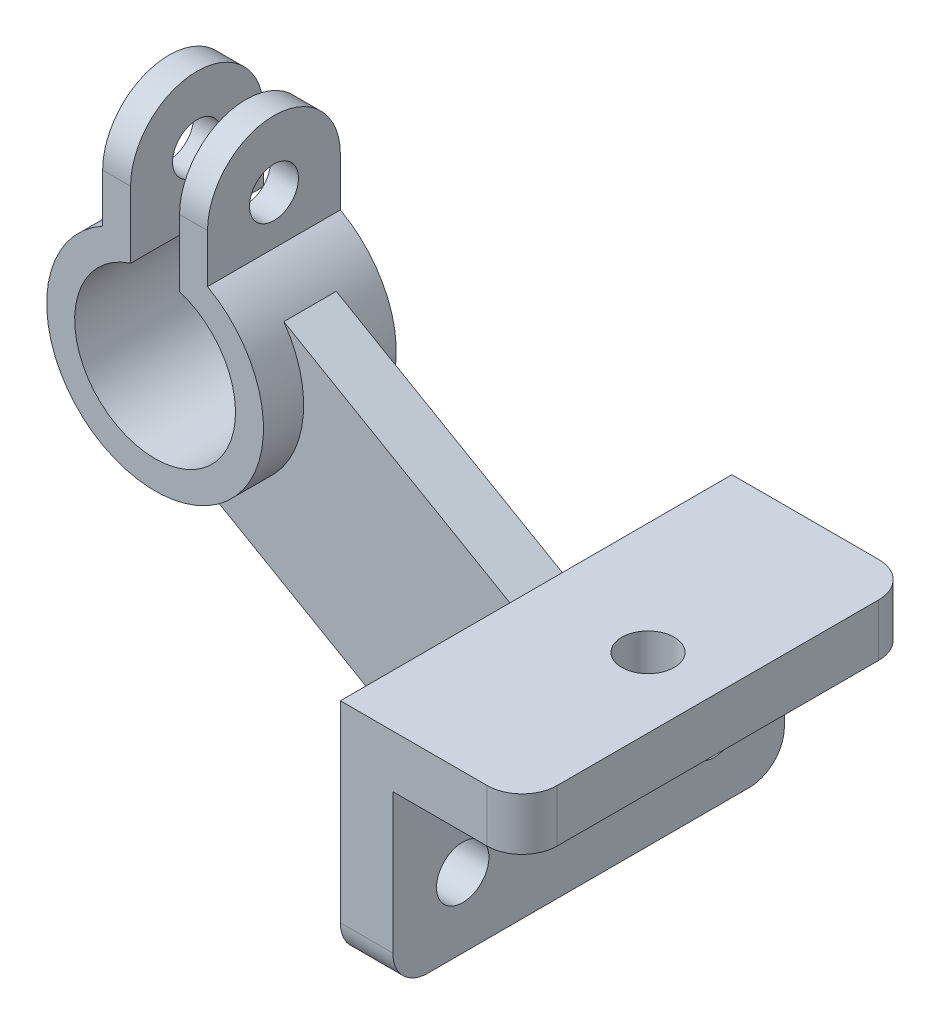
ISO-10303-21;
HEADER;
FILE_DESCRIPTION(('STEP AP214'),'2;1');
FILE_NAME('part.step','',(''),(''),'','','');
FILE_SCHEMA(('AUTOMOTIVE_DESIGN { 1 0 10303 214 1 1 1 1 }'));
ENDSEC;
DATA;
#1=APPLICATION_CONTEXT('core data for automotive mechanical design processes');
#2=APPLICATION_PROTOCOL_DEFINITION('international standard','automotive_design',2000,#1);
#3=PRODUCT_CONTEXT('',#1,'mechanical');
#4=PRODUCT('Part','Part','',(#3));
#5=PRODUCT_RELATED_PRODUCT_CATEGORY('part','',(#4));
#6=PRODUCT_DEFINITION_FORMATION('','',#4);
#7=PRODUCT_DEFINITION_CONTEXT('part definition',#1,'design');
#8=PRODUCT_DEFINITION('design','',#6,#7);
#9=PRODUCT_DEFINITION_SHAPE('','',#8);
#10=(LENGTH_UNIT() NAMED_UNIT(*) SI_UNIT(.MILLI.,.METRE.));
#11=(NAMED_UNIT(*) PLANE_ANGLE_UNIT() SI_UNIT($,.RADIAN.));
#12=(NAMED_UNIT(*) SI_UNIT($,.STERADIAN.) SOLID_ANGLE_UNIT());
#13=UNCERTAINTY_MEASURE_WITH_UNIT(LENGTH_MEASURE(1.E-05),#10,'distance_accuracy_value','');
#14=(GEOMETRIC_REPRESENTATION_CONTEXT(3) GLOBAL_UNCERTAINTY_ASSIGNED_CONTEXT((#13)) GLOBAL_UNIT_ASSIGNED_CONTEXT((#10,
#11,#12)) REPRESENTATION_CONTEXT('',''));
#15=CARTESIAN_POINT('',(0.,0.,0.));
#16=DIRECTION('',(0.,0.,1.));
#17=DIRECTION('',(1.,0.,0.));
#18=AXIS2_PLACEMENT_3D('',#15,#16,#17);
#19=CARTESIAN_POINT('',(-97.,125.461524227066,0.));
#20=DIRECTION('',(-1.,0.,0.));
#21=DIRECTION('',(0.,0.,1.));
#22=AXIS2_PLACEMENT_3D('',#19,#20,#21);
#23=CYLINDRICAL_SURFACE('',#22,19.);
#24=DIRECTION('',(1.,0.,0.));
#25=VECTOR('',#24,1.);
#26=CARTESIAN_POINT('',(-97.,125.461524227066,19.));
#27=LINE('',#26,#25);
#28=CARTESIAN_POINT('',(-97.,125.461524227066,19.));
#29=VERTEX_POINT('',#28);
#30=CARTESIAN_POINT('',(-105.,125.461524227066,19.));
#31=VERTEX_POINT('',#30);
#32=EDGE_CURVE('E322',#29,#31,#27,.F.);
#33=ORIENTED_EDGE('',*,*,#32,.F.);
#34=CARTESIAN_POINT('',(-97.,125.461524227066,0.));
#35=DIRECTION('',(-1.,0.,0.));
#36=DIRECTION('',(0.,0.,1.));
#37=AXIS2_PLACEMENT_3D('',#34,#35,#36);
#38=CIRCLE('',#37,19.);
#39=CARTESIAN_POINT('',(-97.,125.461524227066,-19.));
#40=VERTEX_POINT('',#39);
#41=EDGE_CURVE('E328',#40,#29,#38,.F.);
#42=ORIENTED_EDGE('',*,*,#41,.F.);
#43=DIRECTION('',(-1.,0.,0.));
#44=VECTOR('',#43,1.);
#45=CARTESIAN_POINT('',(-90.,125.461524227066,-19.));
#46=LINE('',#45,#44);
#47=CARTESIAN_POINT('',(-105.,125.461524227066,-19.));
#48=VERTEX_POINT('',#47);
#49=EDGE_CURVE('E325',#48,#40,#46,.F.);
#50=ORIENTED_EDGE('',*,*,#49,.F.);
#51=CARTESIAN_POINT('',(-105.,125.461524227066,0.));
#52=DIRECTION('',(1.,0.,0.));
#53=DIRECTION('',(0.,0.,-1.));
#54=AXIS2_PLACEMENT_3D('',#51,#52,#53);
#55=CIRCLE('',#54,19.);
#56=EDGE_CURVE('E330',#31,#48,#55,.F.);
#57=ORIENTED_EDGE('',*,*,#56,.F.);
#58=EDGE_LOOP('',(#33,#42,#50,#57));
#59=FACE_BOUND('',#58,.T.);
#60=ADVANCED_FACE('F38',(#59),#23,.T.);
#61=CARTESIAN_POINT('',(-75.,125.461524227066,0.));
#62=DIRECTION('',(-1.,0.,0.));
#63=DIRECTION('',(0.,0.,1.));
#64=AXIS2_PLACEMENT_3D('',#61,#62,#63);
#65=CYLINDRICAL_SURFACE('',#64,19.);
#66=DIRECTION('',(1.,0.,0.));
#67=VECTOR('',#66,1.);
#68=CARTESIAN_POINT('',(-75.,125.461524227066,19.));
#69=LINE('',#68,#67);
#70=CARTESIAN_POINT('',(-75.,125.461524227066,19.));
#71=VERTEX_POINT('',#70);
#72=CARTESIAN_POINT('',(-83.,125.461524227066,19.));
#73=VERTEX_POINT('',#72);
#74=EDGE_CURVE('E213',#71,#73,#69,.F.);
#75=ORIENTED_EDGE('',*,*,#74,.F.);
#76=CARTESIAN_POINT('',(-75.,125.461524227066,0.));
#77=DIRECTION('',(-1.,0.,0.));
#78=DIRECTION('',(0.,0.,1.));
#79=AXIS2_PLACEMENT_3D('',#76,#77,#78);
#80=CIRCLE('',#79,19.);
#81=CARTESIAN_POINT('',(-75.,125.461524227066,-19.));
#82=VERTEX_POINT('',#81);
#83=EDGE_CURVE('E318',#82,#71,#80,.F.);
#84=ORIENTED_EDGE('',*,*,#83,.F.);
#85=DIRECTION('',(-1.,0.,0.));
#86=VECTOR('',#85,1.);
#87=CARTESIAN_POINT('',(-90.,125.461524227066,-19.));
#88=LINE('',#87,#86);
#89=CARTESIAN_POINT('',(-83.,125.461524227066,-19.));
#90=VERTEX_POINT('',#89);
#91=EDGE_CURVE('E315',#90,#82,#88,.F.);
#92=ORIENTED_EDGE('',*,*,#91,.F.);
#93=CARTESIAN_POINT('',(-83.,125.461524227066,0.));
#94=DIRECTION('',(1.,0.,0.));
#95=DIRECTION('',(0.,0.,-1.));
#96=AXIS2_PLACEMENT_3D('',#93,#94,#95);
#97=CIRCLE('',#96,19.);
#98=EDGE_CURVE('E320',#73,#90,#97,.F.);
#99=ORIENTED_EDGE('',*,*,#98,.F.);
#100=EDGE_LOOP('',(#75,#84,#92,#99));
#101=FACE_BOUND('',#100,.T.);
#102=ADVANCED_FACE('F437',(#101),#65,.T.);
#103=CARTESIAN_POINT('',(0.,65.,7.5));
#104=DIRECTION('',(-0.500000000000001,-0.866025403784438,0.));
#105=DIRECTION('',(0.866025403784438,-0.500000000000001,0.));
#106=AXIS2_PLACEMENT_3D('',#103,#104,#105);
#107=PLANE('',#106);
#108=DIRECTION('',(0.,0.,-1.));
#109=VECTOR('',#108,1.);
#110=CARTESIAN_POINT('',(-64.6750040480351,102.340130996973,19.));
#111=LINE('',#110,#109);
#112=CARTESIAN_POINT('',(-64.675004048035,102.340130996973,7.5));
#113=VERTEX_POINT('',#112);
#114=CARTESIAN_POINT('',(-64.675004048035,102.340130996973,-7.5));
#115=VERTEX_POINT('',#114);
#116=EDGE_CURVE('E243',#113,#115,#111,.T.);
#117=ORIENTED_EDGE('',*,*,#116,.F.);
#118=DIRECTION('',(-0.866025403784438,0.500000000000001,0.));
#119=VECTOR('',#118,1.);
#120=CARTESIAN_POINT('',(0.,65.,7.5));
#121=LINE('',#120,#119);
#122=CARTESIAN_POINT('',(0.,65.,7.5));
#123=VERTEX_POINT('',#122);
#124=EDGE_CURVE('E252',#123,#113,#121,.T.);
#125=ORIENTED_EDGE('',*,*,#124,.F.);
#126=DIRECTION('',(0.,0.,-1.));
#127=VECTOR('',#126,1.);
#128=CARTESIAN_POINT('',(0.,65.,7.5));
#129=LINE('',#128,#127);
#130=CARTESIAN_POINT('',(0.,65.,-7.5));
#131=VERTEX_POINT('',#130);
#132=EDGE_CURVE('E267',#123,#131,#129,.T.);
#133=ORIENTED_EDGE('',*,*,#132,.T.);
#134=DIRECTION('',(-0.866025403784438,0.500000000000001,0.));
#135=VECTOR('',#134,1.);
#136=CARTESIAN_POINT('',(0.,65.,-7.5));
#137=LINE('',#136,#135);
#138=EDGE_CURVE('E261',#131,#115,#137,.T.);
#139=ORIENTED_EDGE('',*,*,#138,.T.);
#140=EDGE_LOOP('',(#117,#125,#133,#139));
#141=FACE_BOUND('',#140,.T.);
#142=ADVANCED_FACE('F434',(#141),#107,.F.);
#143=CARTESIAN_POINT('',(-104.072912811497,60.0865242270664,7.5));
#144=DIRECTION('',(0.500000000000001,0.866025403784438,0.));
#145=DIRECTION('',(-0.866025403784438,0.500000000000001,0.));
#146=AXIS2_PLACEMENT_3D('',#143,#144,#145);
#147=PLANE('',#146);
#148=DIRECTION('',(0.,0.,-1.));
#149=VECTOR('',#148,1.);
#150=CARTESIAN_POINT('',(-92.8208296710294,53.5901309969733,19.));
#151=LINE('',#150,#149);
#152=CARTESIAN_POINT('',(-92.8208296710294,53.5901309969733,-7.5));
#153=VERTEX_POINT('',#152);
#154=CARTESIAN_POINT('',(-92.8208296710294,53.5901309969733,7.5));
#155=VERTEX_POINT('',#154);
#156=EDGE_CURVE('E240',#153,#155,#151,.F.);
#157=ORIENTED_EDGE('',*,*,#156,.F.);
#158=DIRECTION('',(0.866025403784438,-0.500000000000001,0.));
#159=VECTOR('',#158,1.);
#160=CARTESIAN_POINT('',(-104.072912811497,60.0865242270664,-7.5));
#161=LINE('',#160,#159);
#162=CARTESIAN_POINT('',(0.,0.,-7.5));
#163=VERTEX_POINT('',#162);
#164=EDGE_CURVE('E253',#153,#163,#161,.T.);
#165=ORIENTED_EDGE('',*,*,#164,.T.);
#166=DIRECTION('',(0.,0.,-1.));
#167=VECTOR('',#166,1.);
#168=CARTESIAN_POINT('',(0.,0.,7.5));
#169=LINE('',#168,#167);
#170=CARTESIAN_POINT('',(0.,0.,7.5));
#171=VERTEX_POINT('',#170);
#172=EDGE_CURVE('E259',#171,#163,#169,.T.);
#173=ORIENTED_EDGE('',*,*,#172,.F.);
#174=DIRECTION('',(0.866025403784438,-0.500000000000001,0.));
#175=VECTOR('',#174,1.);
#176=CARTESIAN_POINT('',(-104.072912811497,60.0865242270664,7.5));
#177=LINE('',#176,#175);
#178=EDGE_CURVE('E256',#155,#171,#177,.T.);
#179=ORIENTED_EDGE('',*,*,#178,.F.);
#180=EDGE_LOOP('',(#157,#165,#173,#179));
#181=FACE_BOUND('',#180,.T.);
#182=ADVANCED_FACE('F426',(#181),#147,.F.);
#183=CARTESIAN_POINT('',(0.,0.,56.));
#184=DIRECTION('',(1.,0.,0.));
#185=DIRECTION('',(0.,0.,-1.));
#186=AXIS2_PLACEMENT_3D('',#183,#184,#185);
#187=PLANE('',#186);
#188=CARTESIAN_POINT('',(0.,20.,36.));
#189=DIRECTION('',(1.,0.,0.));
#190=DIRECTION('',(0.,0.,-1.));
#191=AXIS2_PLACEMENT_3D('',#188,#189,#190);
#192=CIRCLE('',#191,7.5);
#193=CARTESIAN_POINT('',(0.,20.,28.5));
#194=VERTEX_POINT('',#193);
#195=EDGE_CURVE('E748',#194,#194,#192,.F.);
#196=ORIENTED_EDGE('',*,*,#195,.F.);
#197=EDGE_LOOP('',(#196));
#198=FACE_BOUND('',#197,.T.);
#199=DIRECTION('',(0.,0.,-1.));
#200=VECTOR('',#199,1.);
#201=CARTESIAN_POINT('',(0.,0.,56.));
#202=LINE('',#201,#200);
#203=CARTESIAN_POINT('',(0.,0.,46.));
#204=VERTEX_POINT('',#203);
#205=EDGE_CURVE('E290',#204,#171,#202,.T.);
#206=ORIENTED_EDGE('',*,*,#205,.F.);
#207=CARTESIAN_POINT('',(0.,10.,46.));
#208=DIRECTION('',(1.,0.,0.));
#209=DIRECTION('',(0.,0.,-1.));
#210=AXIS2_PLACEMENT_3D('',#207,#208,#209);
#211=CIRCLE('',#210,10.);
#212=CARTESIAN_POINT('',(0.,10.,56.));
#213=VERTEX_POINT('',#212);
#214=EDGE_CURVE('E358',#204,#213,#211,.F.);
#215=ORIENTED_EDGE('',*,*,#214,.T.);
#216=DIRECTION('',(0.,-1.,0.));
#217=VECTOR('',#216,1.);
#218=CARTESIAN_POINT('',(0.,0.,56.));
#219=LINE('',#218,#217);
#220=CARTESIAN_POINT('',(0.,65.,56.));
#221=VERTEX_POINT('',#220);
#222=EDGE_CURVE('E279',#221,#213,#219,.T.);
#223=ORIENTED_EDGE('',*,*,#222,.F.);
#224=DIRECTION('',(0.,0.,-1.));
#225=VECTOR('',#224,1.);
#226=CARTESIAN_POINT('',(0.,65.,56.));
#227=LINE('',#226,#225);
#228=EDGE_CURVE('E293',#221,#123,#227,.T.);
#229=ORIENTED_EDGE('',*,*,#228,.T.);
#230=DIRECTION('',(0.,1.,0.));
#231=VECTOR('',#230,1.);
#232=CARTESIAN_POINT('',(0.,65.,7.5));
#233=LINE('',#232,#231);
#234=EDGE_CURVE('E249',#171,#123,#233,.T.);
#235=ORIENTED_EDGE('',*,*,#234,.F.);
#236=EDGE_LOOP('',(#206,#215,#223,#229,#235));
#237=FACE_BOUND('',#236,.T.);
#238=ADVANCED_FACE('F415',(#198,#237),#187,.F.);
#239=CARTESIAN_POINT('',(15.,0.,56.));
#240=DIRECTION('',(0.,1.,0.));
#241=DIRECTION('',(0.,0.,1.));
#242=AXIS2_PLACEMENT_3D('',#239,#240,#241);
#243=PLANE('',#242);
#244=CARTESIAN_POINT('',(0.,0.,-46.));
#245=VERTEX_POINT('',#244);
#246=EDGE_CURVE('E282',#163,#245,#202,.T.);
#247=ORIENTED_EDGE('',*,*,#246,.T.);
#248=DIRECTION('',(1.,0.,0.));
#249=VECTOR('',#248,1.);
#250=CARTESIAN_POINT('',(15.,0.,-46.));
#251=LINE('',#250,#249);
#252=CARTESIAN_POINT('',(15.,0.,-46.));
#253=VERTEX_POINT('',#252);
#254=EDGE_CURVE('E339',#245,#253,#251,.T.);
#255=ORIENTED_EDGE('',*,*,#254,.T.);
#256=DIRECTION('',(0.,0.,-1.));
#257=VECTOR('',#256,1.);
#258=CARTESIAN_POINT('',(15.,0.,56.));
#259=LINE('',#258,#257);
#260=CARTESIAN_POINT('',(15.,0.,46.));
#261=VERTEX_POINT('',#260);
#262=EDGE_CURVE('E303',#261,#253,#259,.T.);
#263=ORIENTED_EDGE('',*,*,#262,.F.);
#264=DIRECTION('',(1.,0.,0.));
#265=VECTOR('',#264,1.);
#266=CARTESIAN_POINT('',(15.,0.,46.));
#267=LINE('',#266,#265);
#268=EDGE_CURVE('E332',#261,#204,#267,.F.);
#269=ORIENTED_EDGE('',*,*,#268,.T.);
#270=ORIENTED_EDGE('',*,*,#205,.T.);
#271=ORIENTED_EDGE('',*,*,#172,.T.);
#272=EDGE_LOOP('',(#247,#255,#263,#269,#270,#271));
#273=FACE_BOUND('',#272,.T.);
#274=ADVANCED_FACE('F404',(#273),#243,.F.);
#275=CARTESIAN_POINT('',(15.,50.,56.));
#276=DIRECTION('',(-1.,0.,0.));
#277=DIRECTION('',(0.,-1.,0.));
#278=AXIS2_PLACEMENT_3D('',#275,#276,#277);
#279=PLANE('',#278);
#280=CARTESIAN_POINT('',(15.,20.,36.));
#281=DIRECTION('',(1.,0.,0.));
#282=DIRECTION('',(0.,1.,0.));
#283=AXIS2_PLACEMENT_3D('',#280,#281,#282);
#284=CIRCLE('',#283,7.5);
#285=CARTESIAN_POINT('',(15.,27.5,36.));
#286=VERTEX_POINT('',#285);
#287=EDGE_CURVE('E752',#286,#286,#284,.T.);
#288=ORIENTED_EDGE('',*,*,#287,.F.);
#289=EDGE_LOOP('',(#288));
#290=FACE_BOUND('',#289,.T.);
#291=CARTESIAN_POINT('',(15.,20.,-36.));
#292=DIRECTION('',(1.,0.,0.));
#293=DIRECTION('',(0.,1.,0.));
#294=AXIS2_PLACEMENT_3D('',#291,#292,#293);
#295=CIRCLE('',#294,7.5);
#296=CARTESIAN_POINT('',(15.,27.5,-36.));
#297=VERTEX_POINT('',#296);
#298=EDGE_CURVE('E753',#297,#297,#295,.T.);
#299=ORIENTED_EDGE('',*,*,#298,.F.);
#300=EDGE_LOOP('',(#299));
#301=FACE_BOUND('',#300,.T.);
#302=ORIENTED_EDGE('',*,*,#262,.T.);
#303=CARTESIAN_POINT('',(15.,10.,-46.));
#304=DIRECTION('',(-1.,0.,0.));
#305=DIRECTION('',(0.,-1.,0.));
#306=AXIS2_PLACEMENT_3D('',#303,#304,#305);
#307=CIRCLE('',#306,10.);
#308=CARTESIAN_POINT('',(15.,10.,-56.));
#309=VERTEX_POINT('',#308);
#310=EDGE_CURVE('E344',#253,#309,#307,.F.);
#311=ORIENTED_EDGE('',*,*,#310,.T.);
#312=DIRECTION('',(0.,1.,0.));
#313=VECTOR('',#312,1.);
#314=CARTESIAN_POINT('',(15.,50.,-56.));
#315=LINE('',#314,#313);
#316=CARTESIAN_POINT('',(15.,50.,-56.));
#317=VERTEX_POINT('',#316);
#318=EDGE_CURVE('E270',#309,#317,#315,.T.);
#319=ORIENTED_EDGE('',*,*,#318,.T.);
#320=DIRECTION('',(0.,0.,-1.));
#321=VECTOR('',#320,1.);
#322=CARTESIAN_POINT('',(15.,50.,56.));
#323=LINE('',#322,#321);
#324=CARTESIAN_POINT('',(15.,50.,56.));
#325=VERTEX_POINT('',#324);
#326=EDGE_CURVE('E300',#325,#317,#323,.T.);
#327=ORIENTED_EDGE('',*,*,#326,.F.);
#328=DIRECTION('',(0.,1.,0.));
#329=VECTOR('',#328,1.);
#330=CARTESIAN_POINT('',(15.,50.,56.));
#331=LINE('',#330,#329);
#332=CARTESIAN_POINT('',(15.,10.,56.));
#333=VERTEX_POINT('',#332);
#334=EDGE_CURVE('E271',#333,#325,#331,.T.);
#335=ORIENTED_EDGE('',*,*,#334,.F.);
#336=CARTESIAN_POINT('',(15.,10.,46.));
#337=DIRECTION('',(-1.,0.,0.));
#338=DIRECTION('',(0.,-1.,0.));
#339=AXIS2_PLACEMENT_3D('',#336,#337,#338);
#340=CIRCLE('',#339,10.);
#341=EDGE_CURVE('E342',#333,#261,#340,.F.);
#342=ORIENTED_EDGE('',*,*,#341,.T.);
#343=EDGE_LOOP('',(#302,#311,#319,#327,#335,#342));
#344=FACE_BOUND('',#343,.T.);
#345=ADVANCED_FACE('F407',(#290,#301,#344),#279,.F.);
#346=CARTESIAN_POINT('',(52.,50.,56.));
#347=DIRECTION('',(0.,1.,0.));
#348=DIRECTION('',(0.,0.,1.));
#349=AXIS2_PLACEMENT_3D('',#346,#347,#348);
#350=PLANE('',#349);
#351=CARTESIAN_POINT('',(32.,50.,0.));
#352=DIRECTION('',(0.,1.,0.));
#353=DIRECTION('',(0.,0.,1.));
#354=AXIS2_PLACEMENT_3D('',#351,#352,#353);
#355=CIRCLE('',#354,7.5);
#356=CARTESIAN_POINT('',(32.,50.,7.5));
#357=VERTEX_POINT('',#356);
#358=EDGE_CURVE('E734',#357,#357,#355,.F.);
#359=ORIENTED_EDGE('',*,*,#358,.F.);
#360=EDGE_LOOP('',(#359));
#361=FACE_BOUND('',#360,.T.);
#362=DIRECTION('',(1.,0.,0.));
#363=VECTOR('',#362,1.);
#364=CARTESIAN_POINT('',(52.,50.,-56.));
#365=LINE('',#364,#363);
#366=CARTESIAN_POINT('',(42.,50.,-56.));
#367=VERTEX_POINT('',#366);
#368=EDGE_CURVE('E284',#317,#367,#365,.T.);
#369=ORIENTED_EDGE('',*,*,#368,.T.);
#370=CARTESIAN_POINT('',(42.,50.,-46.));
#371=DIRECTION('',(0.,1.,0.));
#372=DIRECTION('',(0.,0.,1.));
#373=AXIS2_PLACEMENT_3D('',#370,#371,#372);
#374=CIRCLE('',#373,10.);
#375=CARTESIAN_POINT('',(52.,50.,-46.));
#376=VERTEX_POINT('',#375);
#377=EDGE_CURVE('E11',#367,#376,#374,.F.);
#378=ORIENTED_EDGE('',*,*,#377,.T.);
#379=DIRECTION('',(0.,0.,-1.));
#380=VECTOR('',#379,1.);
#381=CARTESIAN_POINT('',(52.,50.,56.));
#382=LINE('',#381,#380);
#383=CARTESIAN_POINT('',(52.,50.,46.));
#384=VERTEX_POINT('',#383);
#385=EDGE_CURVE('E298',#384,#376,#382,.T.);
#386=ORIENTED_EDGE('',*,*,#385,.F.);
#387=CARTESIAN_POINT('',(42.,50.,46.));
#388=DIRECTION('',(0.,1.,0.));
#389=DIRECTION('',(0.,0.,1.));
#390=AXIS2_PLACEMENT_3D('',#387,#388,#389);
#391=CIRCLE('',#390,10.);
#392=CARTESIAN_POINT('',(42.,50.,56.));
#393=VERTEX_POINT('',#392);
#394=EDGE_CURVE('E46',#384,#393,#391,.F.);
#395=ORIENTED_EDGE('',*,*,#394,.T.);
#396=DIRECTION('',(1.,0.,0.));
#397=VECTOR('',#396,1.);
#398=CARTESIAN_POINT('',(52.,50.,56.));
#399=LINE('',#398,#397);
#400=EDGE_CURVE('E273',#325,#393,#399,.T.);
#401=ORIENTED_EDGE('',*,*,#400,.F.);
#402=ORIENTED_EDGE('',*,*,#326,.T.);
#403=EDGE_LOOP('',(#369,#378,#386,#395,#401,#402));
#404=FACE_BOUND('',#403,.T.);
#405=ADVANCED_FACE('F369',(#361,#404),#350,.F.);
#406=CARTESIAN_POINT('',(52.,65.,56.));
#407=DIRECTION('',(-1.,0.,0.));
#408=DIRECTION('',(0.,-1.,0.));
#409=AXIS2_PLACEMENT_3D('',#406,#407,#408);
#410=PLANE('',#409);
#411=ORIENTED_EDGE('',*,*,#385,.T.);
#412=DIRECTION('',(0.,1.,0.));
#413=VECTOR('',#412,1.);
#414=CARTESIAN_POINT('',(52.,65.,-46.));
#415=LINE('',#414,#413);
#416=CARTESIAN_POINT('',(52.,65.,-46.));
#417=VERTEX_POINT('',#416);
#418=EDGE_CURVE('E361',#376,#417,#415,.T.);
#419=ORIENTED_EDGE('',*,*,#418,.T.);
#420=DIRECTION('',(0.,0.,-1.));
#421=VECTOR('',#420,1.);
#422=CARTESIAN_POINT('',(52.,65.,56.));
#423=LINE('',#422,#421);
#424=CARTESIAN_POINT('',(52.,65.,46.));
#425=VERTEX_POINT('',#424);
#426=EDGE_CURVE('E295',#425,#417,#423,.T.);
#427=ORIENTED_EDGE('',*,*,#426,.F.);
#428=DIRECTION('',(0.,1.,0.));
#429=VECTOR('',#428,1.);
#430=CARTESIAN_POINT('',(52.,65.,46.));
#431=LINE('',#430,#429);
#432=EDGE_CURVE('E58',#425,#384,#431,.F.);
#433=ORIENTED_EDGE('',*,*,#432,.T.);
#434=EDGE_LOOP('',(#411,#419,#427,#433));
#435=FACE_BOUND('',#434,.T.);
#436=ADVANCED_FACE('F380',(#435),#410,.F.);
#437=CARTESIAN_POINT('',(0.,65.,56.));
#438=DIRECTION('',(0.,-1.,0.));
#439=DIRECTION('',(0.,0.,-1.));
#440=AXIS2_PLACEMENT_3D('',#437,#438,#439);
#441=PLANE('',#440);
#442=CARTESIAN_POINT('',(32.,65.,0.));
#443=DIRECTION('',(0.,1.,0.));
#444=DIRECTION('',(0.,0.,1.));
#445=AXIS2_PLACEMENT_3D('',#442,#443,#444);
#446=CIRCLE('',#445,7.5);
#447=CARTESIAN_POINT('',(32.,65.,7.5));
#448=VERTEX_POINT('',#447);
#449=EDGE_CURVE('E737',#448,#448,#446,.T.);
#450=ORIENTED_EDGE('',*,*,#449,.F.);
#451=EDGE_LOOP('',(#450));
#452=FACE_BOUND('',#451,.T.);
#453=ORIENTED_EDGE('',*,*,#426,.T.);
#454=CARTESIAN_POINT('',(42.,65.,-46.));
#455=DIRECTION('',(0.,-1.,0.));
#456=DIRECTION('',(0.,0.,-1.));
#457=AXIS2_PLACEMENT_3D('',#454,#455,#456);
#458=CIRCLE('',#457,10.);
#459=CARTESIAN_POINT('',(42.,65.,-56.));
#460=VERTEX_POINT('',#459);
#461=EDGE_CURVE('E366',#417,#460,#458,.F.);
#462=ORIENTED_EDGE('',*,*,#461,.T.);
#463=DIRECTION('',(-1.,0.,0.));
#464=VECTOR('',#463,1.);
#465=CARTESIAN_POINT('',(0.,65.,-56.));
#466=LINE('',#465,#464);
#467=CARTESIAN_POINT('',(0.,65.,-56.));
#468=VERTEX_POINT('',#467);
#469=EDGE_CURVE('E286',#460,#468,#466,.T.);
#470=ORIENTED_EDGE('',*,*,#469,.T.);
#471=EDGE_CURVE('E292',#131,#468,#227,.T.);
#472=ORIENTED_EDGE('',*,*,#471,.F.);
#473=ORIENTED_EDGE('',*,*,#132,.F.);
#474=ORIENTED_EDGE('',*,*,#228,.F.);
#475=DIRECTION('',(-1.,0.,0.));
#476=VECTOR('',#475,1.);
#477=CARTESIAN_POINT('',(0.,65.,56.));
#478=LINE('',#477,#476);
#479=CARTESIAN_POINT('',(42.,65.,56.));
#480=VERTEX_POINT('',#479);
#481=EDGE_CURVE('E277',#480,#221,#478,.T.);
#482=ORIENTED_EDGE('',*,*,#481,.F.);
#483=CARTESIAN_POINT('',(42.,65.,46.));
#484=DIRECTION('',(0.,-1.,0.));
#485=DIRECTION('',(0.,0.,-1.));
#486=AXIS2_PLACEMENT_3D('',#483,#484,#485);
#487=CIRCLE('',#486,10.);
#488=EDGE_CURVE('E364',#480,#425,#487,.F.);
#489=ORIENTED_EDGE('',*,*,#488,.T.);
#490=EDGE_LOOP('',(#453,#462,#470,#472,#473,#474,#482,#489));
#491=FACE_BOUND('',#490,.T.);
#492=ADVANCED_FACE('F378',(#452,#491),#441,.F.);
#493=CARTESIAN_POINT('',(0.,20.,-36.));
#494=DIRECTION('',(1.,0.,0.));
#495=DIRECTION('',(0.,0.,-1.));
#496=AXIS2_PLACEMENT_3D('',#493,#494,#495);
#497=CIRCLE('',#496,7.5);
#498=CARTESIAN_POINT('',(0.,20.,-43.5));
#499=VERTEX_POINT('',#498);
#500=EDGE_CURVE('E749',#499,#499,#497,.F.);
#501=ORIENTED_EDGE('',*,*,#500,.F.);
#502=EDGE_LOOP('',(#501));
#503=FACE_BOUND('',#502,.T.);
#504=DIRECTION('',(0.,-1.,0.));
#505=VECTOR('',#504,1.);
#506=CARTESIAN_POINT('',(0.,0.,-56.));
#507=LINE('',#506,#505);
#508=CARTESIAN_POINT('',(0.,10.,-56.));
#509=VERTEX_POINT('',#508);
#510=EDGE_CURVE('E274',#468,#509,#507,.T.);
#511=ORIENTED_EDGE('',*,*,#510,.T.);
#512=CARTESIAN_POINT('',(0.,10.,-46.));
#513=DIRECTION('',(1.,0.,0.));
#514=DIRECTION('',(0.,0.,-1.));
#515=AXIS2_PLACEMENT_3D('',#512,#513,#514);
#516=CIRCLE('',#515,10.);
#517=EDGE_CURVE('E350',#509,#245,#516,.F.);
#518=ORIENTED_EDGE('',*,*,#517,.T.);
#519=ORIENTED_EDGE('',*,*,#246,.F.);
#520=DIRECTION('',(0.,1.,0.));
#521=VECTOR('',#520,1.);
#522=CARTESIAN_POINT('',(0.,65.,-7.5));
#523=LINE('',#522,#521);
#524=EDGE_CURVE('E248',#163,#131,#523,.T.);
#525=ORIENTED_EDGE('',*,*,#524,.T.);
#526=ORIENTED_EDGE('',*,*,#471,.T.);
#527=EDGE_LOOP('',(#511,#518,#519,#525,#526));
#528=FACE_BOUND('',#527,.T.);
#529=ADVANCED_FACE('F396',(#503,#528),#187,.F.);
#530=CARTESIAN_POINT('',(0.,0.,56.));
#531=DIRECTION('',(0.,0.,-1.));
#532=DIRECTION('',(-1.,0.,0.));
#533=AXIS2_PLACEMENT_3D('',#530,#531,#532);
#534=PLANE('',#533);
#535=ORIENTED_EDGE('',*,*,#222,.T.);
#536=DIRECTION('',(1.,0.,0.));
#537=VECTOR('',#536,1.);
#538=CARTESIAN_POINT('',(0.,10.,56.));
#539=LINE('',#538,#537);
#540=EDGE_CURVE('E355',#213,#333,#539,.T.);
#541=ORIENTED_EDGE('',*,*,#540,.T.);
#542=ORIENTED_EDGE('',*,*,#334,.T.);
#543=ORIENTED_EDGE('',*,*,#400,.T.);
#544=DIRECTION('',(0.,1.,0.));
#545=VECTOR('',#544,1.);
#546=CARTESIAN_POINT('',(42.,0.,56.));
#547=LINE('',#546,#545);
#548=EDGE_CURVE('E352',#393,#480,#547,.T.);
#549=ORIENTED_EDGE('',*,*,#548,.T.);
#550=ORIENTED_EDGE('',*,*,#481,.T.);
#551=EDGE_LOOP('',(#535,#541,#542,#543,#549,#550));
#552=FACE_BOUND('',#551,.T.);
#553=ADVANCED_FACE('F373',(#552),#534,.F.);
#554=CARTESIAN_POINT('',(0.,0.,-56.));
#555=DIRECTION('',(0.,0.,-1.));
#556=DIRECTION('',(-1.,0.,0.));
#557=AXIS2_PLACEMENT_3D('',#554,#555,#556);
#558=PLANE('',#557);
#559=ORIENTED_EDGE('',*,*,#318,.F.);
#560=DIRECTION('',(1.,0.,0.));
#561=VECTOR('',#560,1.);
#562=CARTESIAN_POINT('',(0.,10.,-56.));
#563=LINE('',#562,#561);
#564=EDGE_CURVE('E348',#309,#509,#563,.F.);
#565=ORIENTED_EDGE('',*,*,#564,.T.);
#566=ORIENTED_EDGE('',*,*,#510,.F.);
#567=ORIENTED_EDGE('',*,*,#469,.F.);
#568=DIRECTION('',(0.,1.,0.));
#569=VECTOR('',#568,1.);
#570=CARTESIAN_POINT('',(42.,50.,-56.));
#571=LINE('',#570,#569);
#572=EDGE_CURVE('E346',#460,#367,#571,.F.);
#573=ORIENTED_EDGE('',*,*,#572,.T.);
#574=ORIENTED_EDGE('',*,*,#368,.F.);
#575=EDGE_LOOP('',(#559,#565,#566,#567,#573,#574));
#576=FACE_BOUND('',#575,.T.);
#577=ADVANCED_FACE('F391',(#576),#558,.T.);
#578=CARTESIAN_POINT('',(0.,0.,7.5));
#579=DIRECTION('',(0.,0.,1.));
#580=DIRECTION('',(1.,0.,0.));
#581=AXIS2_PLACEMENT_3D('',#578,#579,#580);
#582=PLANE('',#581);
#583=ORIENTED_EDGE('',*,*,#124,.T.);
#584=CARTESIAN_POINT('',(-90.,84.4615242270664,7.5));
#585=DIRECTION('',(0.,0.,1.));
#586=DIRECTION('',(1.,0.,0.));
#587=AXIS2_PLACEMENT_3D('',#584,#585,#586);
#588=CIRCLE('',#587,31.);
#589=EDGE_CURVE('E246',#113,#155,#588,.F.);
#590=ORIENTED_EDGE('',*,*,#589,.T.);
#591=ORIENTED_EDGE('',*,*,#178,.T.);
#592=ORIENTED_EDGE('',*,*,#234,.T.);
#593=EDGE_LOOP('',(#583,#590,#591,#592));
#594=FACE_BOUND('',#593,.T.);
#595=ADVANCED_FACE('F422',(#594),#582,.T.);
#596=CARTESIAN_POINT('',(0.,0.,-7.5));
#597=DIRECTION('',(0.,0.,1.));
#598=DIRECTION('',(1.,0.,0.));
#599=AXIS2_PLACEMENT_3D('',#596,#597,#598);
#600=PLANE('',#599);
#601=CARTESIAN_POINT('',(-90.,84.4615242270664,-7.5));
#602=DIRECTION('',(0.,0.,1.));
#603=DIRECTION('',(1.,0.,0.));
#604=AXIS2_PLACEMENT_3D('',#601,#602,#603);
#605=CIRCLE('',#604,31.);
#606=EDGE_CURVE('E306',#115,#153,#605,.F.);
#607=ORIENTED_EDGE('',*,*,#606,.F.);
#608=ORIENTED_EDGE('',*,*,#138,.F.);
#609=ORIENTED_EDGE('',*,*,#524,.F.);
#610=ORIENTED_EDGE('',*,*,#164,.F.);
#611=EDGE_LOOP('',(#607,#608,#609,#610));
#612=FACE_BOUND('',#611,.T.);
#613=ADVANCED_FACE('F432',(#612),#600,.F.);
#614=CARTESIAN_POINT('',(-90.,84.4615242270664,19.));
#615=DIRECTION('',(0.,0.,-1.));
#616=DIRECTION('',(-1.,0.,0.));
#617=AXIS2_PLACEMENT_3D('',#614,#615,#616);
#618=CYLINDRICAL_SURFACE('',#617,31.);
#619=ORIENTED_EDGE('',*,*,#589,.F.);
#620=ORIENTED_EDGE('',*,*,#116,.T.);
#621=ORIENTED_EDGE('',*,*,#606,.T.);
#622=ORIENTED_EDGE('',*,*,#156,.T.);
#623=EDGE_LOOP('',(#619,#620,#621,#622));
#624=FACE_BOUND('',#623,.T.);
#625=CARTESIAN_POINT('',(-90.,84.4615242270664,-19.));
#626=DIRECTION('',(0.,0.,1.));
#627=DIRECTION('',(1.,0.,0.));
#628=AXIS2_PLACEMENT_3D('',#625,#626,#627);
#629=CIRCLE('',#628,31.);
#630=CARTESIAN_POINT('',(-105.,111.590844159568,-19.));
#631=VERTEX_POINT('',#630);
#632=CARTESIAN_POINT('',(-75.,111.590844159568,-19.));
#633=VERTEX_POINT('',#632);
#634=EDGE_CURVE('E218',#631,#633,#629,.T.);
#635=ORIENTED_EDGE('',*,*,#634,.T.);
#636=DIRECTION('',(0.,0.,-1.));
#637=VECTOR('',#636,1.);
#638=CARTESIAN_POINT('',(-75.,111.590844159568,19.));
#639=LINE('',#638,#637);
#640=CARTESIAN_POINT('',(-75.,111.590844159568,19.));
#641=VERTEX_POINT('',#640);
#642=EDGE_CURVE('E237',#641,#633,#639,.T.);
#643=ORIENTED_EDGE('',*,*,#642,.F.);
#644=CARTESIAN_POINT('',(-90.,84.4615242270664,19.));
#645=DIRECTION('',(0.,0.,1.));
#646=DIRECTION('',(1.,0.,0.));
#647=AXIS2_PLACEMENT_3D('',#644,#645,#646);
#648=CIRCLE('',#647,31.);
#649=CARTESIAN_POINT('',(-105.,111.590844159568,19.));
#650=VERTEX_POINT('',#649);
#651=EDGE_CURVE('E220',#650,#641,#648,.T.);
#652=ORIENTED_EDGE('',*,*,#651,.F.);
#653=DIRECTION('',(0.,0.,-1.));
#654=VECTOR('',#653,1.);
#655=CARTESIAN_POINT('',(-105.,111.590844159568,19.));
#656=LINE('',#655,#654);
#657=EDGE_CURVE('E228',#650,#631,#656,.T.);
#658=ORIENTED_EDGE('',*,*,#657,.T.);
#659=EDGE_LOOP('',(#635,#643,#652,#658));
#660=FACE_BOUND('',#659,.T.);
#661=ADVANCED_FACE('F428',(#624,#660),#618,.T.);
#662=CARTESIAN_POINT('',(-75.,144.461524227066,19.));
#663=DIRECTION('',(-1.,0.,0.));
#664=DIRECTION('',(0.,0.,1.));
#665=AXIS2_PLACEMENT_3D('',#662,#663,#664);
#666=PLANE('',#665);
#667=CARTESIAN_POINT('',(-75.,125.461524227066,0.));
#668=DIRECTION('',(1.,0.,0.));
#669=DIRECTION('',(0.,0.,-1.));
#670=AXIS2_PLACEMENT_3D('',#667,#668,#669);
#671=CIRCLE('',#670,7.);
#672=CARTESIAN_POINT('',(-75.,125.461524227066,-7.));
#673=VERTEX_POINT('',#672);
#674=EDGE_CURVE('E337',#673,#673,#671,.T.);
#675=ORIENTED_EDGE('',*,*,#674,.F.);
#676=EDGE_LOOP('',(#675));
#677=FACE_BOUND('',#676,.T.);
#678=DIRECTION('',(0.,1.,0.));
#679=VECTOR('',#678,1.);
#680=CARTESIAN_POINT('',(-75.,144.461524227066,-19.));
#681=LINE('',#680,#679);
#682=EDGE_CURVE('E231',#633,#82,#681,.T.);
#683=ORIENTED_EDGE('',*,*,#682,.T.);
#684=ORIENTED_EDGE('',*,*,#83,.T.);
#685=DIRECTION('',(0.,1.,0.));
#686=VECTOR('',#685,1.);
#687=CARTESIAN_POINT('',(-75.,144.461524227066,19.));
#688=LINE('',#687,#686);
#689=EDGE_CURVE('E223',#641,#71,#688,.T.);
#690=ORIENTED_EDGE('',*,*,#689,.F.);
#691=ORIENTED_EDGE('',*,*,#642,.T.);
#692=EDGE_LOOP('',(#683,#684,#690,#691));
#693=FACE_BOUND('',#692,.T.);
#694=ADVANCED_FACE('F642',(#677,#693),#666,.F.);
#695=CARTESIAN_POINT('',(-105.,111.590844159568,19.));
#696=DIRECTION('',(1.,0.,0.));
#697=DIRECTION('',(0.,0.,-1.));
#698=AXIS2_PLACEMENT_3D('',#695,#696,#697);
#699=PLANE('',#698);
#700=CARTESIAN_POINT('',(-105.,125.461524227066,0.));
#701=DIRECTION('',(1.,0.,0.));
#702=DIRECTION('',(0.,0.,-1.));
#703=AXIS2_PLACEMENT_3D('',#700,#701,#702);
#704=CIRCLE('',#703,7.);
#705=CARTESIAN_POINT('',(-105.,125.461524227066,-7.));
#706=VERTEX_POINT('',#705);
#707=EDGE_CURVE('E207',#706,#706,#704,.T.);
#708=ORIENTED_EDGE('',*,*,#707,.T.);
#709=EDGE_LOOP('',(#708));
#710=FACE_BOUND('',#709,.T.);
#711=DIRECTION('',(0.,-1.,0.));
#712=VECTOR('',#711,1.);
#713=CARTESIAN_POINT('',(-105.,111.590844159568,19.));
#714=LINE('',#713,#712);
#715=EDGE_CURVE('E226',#31,#650,#714,.T.);
#716=ORIENTED_EDGE('',*,*,#715,.F.);
#717=ORIENTED_EDGE('',*,*,#56,.T.);
#718=DIRECTION('',(0.,-1.,0.));
#719=VECTOR('',#718,1.);
#720=CARTESIAN_POINT('',(-105.,111.590844159568,-19.));
#721=LINE('',#720,#719);
#722=EDGE_CURVE('E224',#48,#631,#721,.T.);
#723=ORIENTED_EDGE('',*,*,#722,.T.);
#724=ORIENTED_EDGE('',*,*,#657,.F.);
#725=EDGE_LOOP('',(#716,#717,#723,#724));
#726=FACE_BOUND('',#725,.T.);
#727=ADVANCED_FACE('F637',(#710,#726),#699,.F.);
#728=CARTESIAN_POINT('',(-90.,84.4615242270664,19.));
#729=DIRECTION('',(0.,0.,1.));
#730=DIRECTION('',(1.,0.,0.));
#731=AXIS2_PLACEMENT_3D('',#728,#729,#730);
#732=PLANE('',#731);
#733=DIRECTION('',(0.,-1.,0.));
#734=VECTOR('',#733,1.);
#735=CARTESIAN_POINT('',(-97.,144.461524227066,19.));
#736=LINE('',#735,#734);
#737=CARTESIAN_POINT('',(-97.,106.370426527273,19.));
#738=VERTEX_POINT('',#737);
#739=EDGE_CURVE('E198',#29,#738,#736,.T.);
#740=ORIENTED_EDGE('',*,*,#739,.F.);
#741=ORIENTED_EDGE('',*,*,#32,.T.);
#742=ORIENTED_EDGE('',*,*,#715,.T.);
#743=ORIENTED_EDGE('',*,*,#651,.T.);
#744=ORIENTED_EDGE('',*,*,#689,.T.);
#745=ORIENTED_EDGE('',*,*,#74,.T.);
#746=DIRECTION('',(0.,1.,0.));
#747=VECTOR('',#746,1.);
#748=CARTESIAN_POINT('',(-83.,106.370426527273,19.));
#749=LINE('',#748,#747);
#750=CARTESIAN_POINT('',(-83.,106.370426527273,19.));
#751=VERTEX_POINT('',#750);
#752=EDGE_CURVE('E191',#751,#73,#749,.T.);
#753=ORIENTED_EDGE('',*,*,#752,.F.);
#754=CARTESIAN_POINT('',(-90.,84.4615242270664,19.));
#755=DIRECTION('',(0.,0.,1.));
#756=DIRECTION('',(1.,0.,0.));
#757=AXIS2_PLACEMENT_3D('',#754,#755,#756);
#758=CIRCLE('',#757,23.);
#759=EDGE_CURVE('E202',#738,#751,#758,.T.);
#760=ORIENTED_EDGE('',*,*,#759,.F.);
#761=EDGE_LOOP('',(#740,#741,#742,#743,#744,#745,#753,#760));
#762=FACE_BOUND('',#761,.T.);
#763=ADVANCED_FACE('F210',(#762),#732,.T.);
#764=CARTESIAN_POINT('',(-90.,84.4615242270664,-19.));
#765=DIRECTION('',(0.,0.,1.));
#766=DIRECTION('',(1.,0.,0.));
#767=AXIS2_PLACEMENT_3D('',#764,#765,#766);
#768=PLANE('',#767);
#769=ORIENTED_EDGE('',*,*,#722,.F.);
#770=ORIENTED_EDGE('',*,*,#49,.T.);
#771=DIRECTION('',(0.,-1.,0.));
#772=VECTOR('',#771,1.);
#773=CARTESIAN_POINT('',(-97.,84.4615242270664,-19.));
#774=LINE('',#773,#772);
#775=CARTESIAN_POINT('',(-97.,106.370426527273,-19.));
#776=VERTEX_POINT('',#775);
#777=EDGE_CURVE('E312',#40,#776,#774,.T.);
#778=ORIENTED_EDGE('',*,*,#777,.T.);
#779=CARTESIAN_POINT('',(-90.,84.4615242270664,-19.));
#780=DIRECTION('',(0.,0.,1.));
#781=DIRECTION('',(1.,0.,0.));
#782=AXIS2_PLACEMENT_3D('',#779,#780,#781);
#783=CIRCLE('',#782,23.);
#784=CARTESIAN_POINT('',(-83.,106.370426527273,-19.));
#785=VERTEX_POINT('',#784);
#786=EDGE_CURVE('E310',#776,#785,#783,.T.);
#787=ORIENTED_EDGE('',*,*,#786,.T.);
#788=DIRECTION('',(0.,1.,0.));
#789=VECTOR('',#788,1.);
#790=CARTESIAN_POINT('',(-83.,84.4615242270664,-19.));
#791=LINE('',#790,#789);
#792=EDGE_CURVE('E193',#785,#90,#791,.T.);
#793=ORIENTED_EDGE('',*,*,#792,.T.);
#794=ORIENTED_EDGE('',*,*,#91,.T.);
#795=ORIENTED_EDGE('',*,*,#682,.F.);
#796=ORIENTED_EDGE('',*,*,#634,.F.);
#797=EDGE_LOOP('',(#769,#770,#778,#787,#793,#794,#795,#796));
#798=FACE_BOUND('',#797,.T.);
#799=ADVANCED_FACE('F661',(#798),#768,.F.);
#800=CARTESIAN_POINT('',(-90.,84.4615242270664,-56.));
#801=DIRECTION('',(0.,0.,1.));
#802=DIRECTION('',(1.,0.,0.));
#803=AXIS2_PLACEMENT_3D('',#800,#801,#802);
#804=CYLINDRICAL_SURFACE('',#803,23.);
#805=DIRECTION('',(0.,0.,1.));
#806=VECTOR('',#805,1.);
#807=CARTESIAN_POINT('',(-97.,106.370426527273,-56.));
#808=LINE('',#807,#806);
#809=EDGE_CURVE('E197',#776,#738,#808,.T.);
#810=ORIENTED_EDGE('',*,*,#809,.T.);
#811=ORIENTED_EDGE('',*,*,#759,.T.);
#812=DIRECTION('',(0.,0.,1.));
#813=VECTOR('',#812,1.);
#814=CARTESIAN_POINT('',(-83.,106.370426527273,-56.));
#815=LINE('',#814,#813);
#816=EDGE_CURVE('E187',#785,#751,#815,.T.);
#817=ORIENTED_EDGE('',*,*,#816,.F.);
#818=ORIENTED_EDGE('',*,*,#786,.F.);
#819=EDGE_LOOP('',(#810,#811,#817,#818));
#820=FACE_BOUND('',#819,.T.);
#821=ADVANCED_FACE('F203',(#820),#804,.F.);
#822=CARTESIAN_POINT('',(-97.,144.461524227066,-56.));
#823=DIRECTION('',(-1.,0.,0.));
#824=DIRECTION('',(0.,0.,1.));
#825=AXIS2_PLACEMENT_3D('',#822,#823,#824);
#826=PLANE('',#825);
#827=CARTESIAN_POINT('',(-97.,125.461524227066,0.));
#828=DIRECTION('',(-1.,0.,0.));
#829=DIRECTION('',(0.,0.,1.));
#830=AXIS2_PLACEMENT_3D('',#827,#828,#829);
#831=CIRCLE('',#830,7.);
#832=CARTESIAN_POINT('',(-97.,125.461524227066,7.));
#833=VERTEX_POINT('',#832);
#834=EDGE_CURVE('E336',#833,#833,#831,.T.);
#835=ORIENTED_EDGE('',*,*,#834,.T.);
#836=EDGE_LOOP('',(#835));
#837=FACE_BOUND('',#836,.T.);
#838=ORIENTED_EDGE('',*,*,#777,.F.);
#839=ORIENTED_EDGE('',*,*,#41,.T.);
#840=ORIENTED_EDGE('',*,*,#739,.T.);
#841=ORIENTED_EDGE('',*,*,#809,.F.);
#842=EDGE_LOOP('',(#838,#839,#840,#841));
#843=FACE_BOUND('',#842,.T.);
#844=ADVANCED_FACE('F619',(#837,#843),#826,.F.);
#845=CARTESIAN_POINT('',(-83.,106.370426527273,-56.));
#846=DIRECTION('',(1.,0.,0.));
#847=DIRECTION('',(0.,0.,-1.));
#848=AXIS2_PLACEMENT_3D('',#845,#846,#847);
#849=PLANE('',#848);
#850=CARTESIAN_POINT('',(-83.,125.461524227066,0.));
#851=DIRECTION('',(1.,0.,0.));
#852=DIRECTION('',(0.,0.,-1.));
#853=AXIS2_PLACEMENT_3D('',#850,#851,#852);
#854=CIRCLE('',#853,7.);
#855=CARTESIAN_POINT('',(-83.,125.461524227066,-7.));
#856=VERTEX_POINT('',#855);
#857=EDGE_CURVE('E333',#856,#856,#854,.T.);
#858=ORIENTED_EDGE('',*,*,#857,.T.);
#859=EDGE_LOOP('',(#858));
#860=FACE_BOUND('',#859,.T.);
#861=ORIENTED_EDGE('',*,*,#752,.T.);
#862=ORIENTED_EDGE('',*,*,#98,.T.);
#863=ORIENTED_EDGE('',*,*,#792,.F.);
#864=ORIENTED_EDGE('',*,*,#816,.T.);
#865=EDGE_LOOP('',(#861,#862,#863,#864));
#866=FACE_BOUND('',#865,.T.);
#867=ADVANCED_FACE('F189',(#860,#866),#849,.F.);
#868=CARTESIAN_POINT('',(-121.,125.461524227066,0.));
#869=DIRECTION('',(1.,0.,0.));
#870=DIRECTION('',(0.,0.,-1.));
#871=AXIS2_PLACEMENT_3D('',#868,#869,#870);
#872=CYLINDRICAL_SURFACE('',#871,7.);
#873=ORIENTED_EDGE('',*,*,#674,.T.);
#874=EDGE_LOOP('',(#873));
#875=FACE_BOUND('',#874,.T.);
#876=ORIENTED_EDGE('',*,*,#857,.F.);
#877=EDGE_LOOP('',(#876));
#878=FACE_BOUND('',#877,.T.);
#879=ADVANCED_FACE('F600',(#875,#878),#872,.F.);
#880=ORIENTED_EDGE('',*,*,#834,.F.);
#881=EDGE_LOOP('',(#880));
#882=FACE_BOUND('',#881,.T.);
#883=ORIENTED_EDGE('',*,*,#707,.F.);
#884=EDGE_LOOP('',(#883));
#885=FACE_BOUND('',#884,.T.);
#886=ADVANCED_FACE('F590',(#882,#885),#872,.F.);
#887=CARTESIAN_POINT('',(32.,-0.001000000000001,0.));
#888=DIRECTION('',(0.,1.,0.));
#889=DIRECTION('',(0.,0.,1.));
#890=AXIS2_PLACEMENT_3D('',#887,#888,#889);
#891=CYLINDRICAL_SURFACE('',#890,7.5);
#892=ORIENTED_EDGE('',*,*,#449,.T.);
#893=EDGE_LOOP('',(#892));
#894=FACE_BOUND('',#893,.T.);
#895=ORIENTED_EDGE('',*,*,#358,.T.);
#896=EDGE_LOOP('',(#895));
#897=FACE_BOUND('',#896,.T.);
#898=ADVANCED_FACE('F580',(#894,#897),#891,.F.);
#899=CARTESIAN_POINT('',(-121.001,20.,-36.));
#900=DIRECTION('',(1.,0.,0.));
#901=DIRECTION('',(0.,1.,0.));
#902=AXIS2_PLACEMENT_3D('',#899,#900,#901);
#903=CYLINDRICAL_SURFACE('',#902,7.5);
#904=ORIENTED_EDGE('',*,*,#298,.T.);
#905=EDGE_LOOP('',(#904));
#906=FACE_BOUND('',#905,.T.);
#907=ORIENTED_EDGE('',*,*,#500,.T.);
#908=EDGE_LOOP('',(#907));
#909=FACE_BOUND('',#908,.T.);
#910=ADVANCED_FACE('F570',(#906,#909),#903,.F.);
#911=CARTESIAN_POINT('',(-121.001,20.,36.));
#912=DIRECTION('',(1.,0.,0.));
#913=DIRECTION('',(0.,1.,0.));
#914=AXIS2_PLACEMENT_3D('',#911,#912,#913);
#915=CYLINDRICAL_SURFACE('',#914,7.5);
#916=ORIENTED_EDGE('',*,*,#287,.T.);
#917=EDGE_LOOP('',(#916));
#918=FACE_BOUND('',#917,.T.);
#919=ORIENTED_EDGE('',*,*,#195,.T.);
#920=EDGE_LOOP('',(#919));
#921=FACE_BOUND('',#920,.T.);
#922=ADVANCED_FACE('F461',(#918,#921),#915,.F.);
#923=CARTESIAN_POINT('',(15.,10.,-46.));
#924=DIRECTION('',(-1.,0.,0.));
#925=DIRECTION('',(0.,0.,1.));
#926=AXIS2_PLACEMENT_3D('',#923,#924,#925);
#927=CYLINDRICAL_SURFACE('',#926,10.);
#928=ORIENTED_EDGE('',*,*,#517,.F.);
#929=ORIENTED_EDGE('',*,*,#564,.F.);
#930=ORIENTED_EDGE('',*,*,#310,.F.);
#931=ORIENTED_EDGE('',*,*,#254,.F.);
#932=EDGE_LOOP('',(#928,#929,#930,#931));
#933=FACE_BOUND('',#932,.T.);
#934=ADVANCED_FACE('F401',(#933),#927,.T.);
#935=CARTESIAN_POINT('',(0.,10.,46.));
#936=DIRECTION('',(1.,0.,0.));
#937=DIRECTION('',(0.,0.,-1.));
#938=AXIS2_PLACEMENT_3D('',#935,#936,#937);
#939=CYLINDRICAL_SURFACE('',#938,10.);
#940=ORIENTED_EDGE('',*,*,#214,.F.);
#941=ORIENTED_EDGE('',*,*,#268,.F.);
#942=ORIENTED_EDGE('',*,*,#341,.F.);
#943=ORIENTED_EDGE('',*,*,#540,.F.);
#944=EDGE_LOOP('',(#940,#941,#942,#943));
#945=FACE_BOUND('',#944,.T.);
#946=ADVANCED_FACE('F411',(#945),#939,.T.);
#947=CARTESIAN_POINT('',(42.,65.,-46.));
#948=DIRECTION('',(0.,-1.,0.));
#949=DIRECTION('',(1.,0.,0.));
#950=AXIS2_PLACEMENT_3D('',#947,#948,#949);
#951=CYLINDRICAL_SURFACE('',#950,10.);
#952=ORIENTED_EDGE('',*,*,#377,.F.);
#953=ORIENTED_EDGE('',*,*,#572,.F.);
#954=ORIENTED_EDGE('',*,*,#461,.F.);
#955=ORIENTED_EDGE('',*,*,#418,.F.);
#956=EDGE_LOOP('',(#952,#953,#954,#955));
#957=FACE_BOUND('',#956,.T.);
#958=ADVANCED_FACE('F383',(#957),#951,.T.);
#959=CARTESIAN_POINT('',(42.,0.,46.));
#960=DIRECTION('',(0.,1.,0.));
#961=DIRECTION('',(-1.,0.,0.));
#962=AXIS2_PLACEMENT_3D('',#959,#960,#961);
#963=CYLINDRICAL_SURFACE('',#962,10.);
#964=ORIENTED_EDGE('',*,*,#394,.F.);
#965=ORIENTED_EDGE('',*,*,#432,.F.);
#966=ORIENTED_EDGE('',*,*,#488,.F.);
#967=ORIENTED_EDGE('',*,*,#548,.F.);
#968=EDGE_LOOP('',(#964,#965,#966,#967));
#969=FACE_BOUND('',#968,.T.);
#970=ADVANCED_FACE('F40',(#969),#963,.T.);
#971=CLOSED_SHELL('',(#60,#102,#142,#182,#238,#274,#345,#405,#436,#492,#529,#553,#577,#595,#613,
#661,#694,#727,#763,#799,#821,#844,#867,#879,#886,#898,#910,#922,#934,#946,#958,#970));
#972=MANIFOLD_SOLID_BREP('B2',#971);
#973=ADVANCED_BREP_SHAPE_REPRESENTATION('',(#18,#972),#14);
#974=SHAPE_DEFINITION_REPRESENTATION(#9,#973);
ENDSEC;
END-ISO-10303-21;
